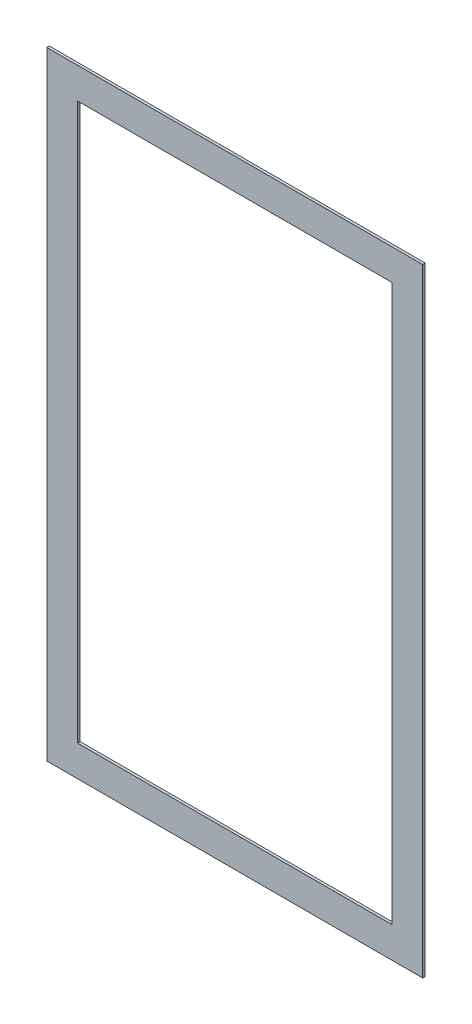
ISO-10303-21;
HEADER;
FILE_DESCRIPTION(('STEP AP214'),'2;1');
FILE_NAME('part.step','',(''),(''),'','','');
FILE_SCHEMA(('AUTOMOTIVE_DESIGN { 1 0 10303 214 1 1 1 1 }'));
ENDSEC;
DATA;
#1=APPLICATION_CONTEXT('core data for automotive mechanical design processes');
#2=APPLICATION_PROTOCOL_DEFINITION('international standard','automotive_design',2000,#1);
#3=PRODUCT_CONTEXT('',#1,'mechanical');
#4=PRODUCT('Part','Part','',(#3));
#5=PRODUCT_RELATED_PRODUCT_CATEGORY('part','',(#4));
#6=PRODUCT_DEFINITION_FORMATION('','',#4);
#7=PRODUCT_DEFINITION_CONTEXT('part definition',#1,'design');
#8=PRODUCT_DEFINITION('design','',#6,#7);
#9=PRODUCT_DEFINITION_SHAPE('','',#8);
#10=(LENGTH_UNIT() NAMED_UNIT(*) SI_UNIT(.MILLI.,.METRE.));
#11=(NAMED_UNIT(*) PLANE_ANGLE_UNIT() SI_UNIT($,.RADIAN.));
#12=(NAMED_UNIT(*) SI_UNIT($,.STERADIAN.) SOLID_ANGLE_UNIT());
#13=UNCERTAINTY_MEASURE_WITH_UNIT(LENGTH_MEASURE(1.E-05),#10,'distance_accuracy_value','');
#14=(GEOMETRIC_REPRESENTATION_CONTEXT(3) GLOBAL_UNCERTAINTY_ASSIGNED_CONTEXT((#13)) GLOBAL_UNIT_ASSIGNED_CONTEXT((#10,
#11,#12)) REPRESENTATION_CONTEXT('',''));
#15=CARTESIAN_POINT('',(0.,0.,0.));
#16=DIRECTION('',(0.,0.,1.));
#17=DIRECTION('',(1.,0.,0.));
#18=AXIS2_PLACEMENT_3D('',#15,#16,#17);
#19=CARTESIAN_POINT('',(0.,0.,6.35));
#20=DIRECTION('',(0.,0.,1.));
#21=DIRECTION('',(1.,0.,0.));
#22=AXIS2_PLACEMENT_3D('',#19,#20,#21);
#23=PLANE('',#22);
#24=DIRECTION('',(0.,-1.,0.));
#25=VECTOR('',#24,1.);
#26=CARTESIAN_POINT('',(-463.55,-762.,6.35));
#27=LINE('',#26,#25);
#28=CARTESIAN_POINT('',(-463.55,762.,6.35));
#29=VERTEX_POINT('',#28);
#30=CARTESIAN_POINT('',(-463.55,-762.,6.35));
#31=VERTEX_POINT('',#30);
#32=EDGE_CURVE('E159',#29,#31,#27,.T.);
#33=ORIENTED_EDGE('',*,*,#32,.T.);
#34=DIRECTION('',(1.,0.,0.));
#35=VECTOR('',#34,1.);
#36=CARTESIAN_POINT('',(463.55,-762.,6.35));
#37=LINE('',#36,#35);
#38=CARTESIAN_POINT('',(463.55,-762.,6.35));
#39=VERTEX_POINT('',#38);
#40=EDGE_CURVE('E163',#31,#39,#37,.T.);
#41=ORIENTED_EDGE('',*,*,#40,.T.);
#42=DIRECTION('',(0.,1.,0.));
#43=VECTOR('',#42,1.);
#44=CARTESIAN_POINT('',(463.55,-762.,6.35));
#45=LINE('',#44,#43);
#46=CARTESIAN_POINT('',(463.55,762.,6.35));
#47=VERTEX_POINT('',#46);
#48=EDGE_CURVE('E167',#39,#47,#45,.T.);
#49=ORIENTED_EDGE('',*,*,#48,.T.);
#50=DIRECTION('',(-1.,0.,0.));
#51=VECTOR('',#50,1.);
#52=CARTESIAN_POINT('',(463.55,762.,6.35));
#53=LINE('',#52,#51);
#54=EDGE_CURVE('E170',#47,#29,#53,.T.);
#55=ORIENTED_EDGE('',*,*,#54,.T.);
#56=EDGE_LOOP('',(#33,#41,#49,#55));
#57=FACE_BOUND('',#56,.T.);
#58=DIRECTION('',(1.,0.,0.));
#59=VECTOR('',#58,1.);
#60=CARTESIAN_POINT('',(387.35,-685.8,6.35));
#61=LINE('',#60,#59);
#62=CARTESIAN_POINT('',(-387.35,-685.8,6.35));
#63=VERTEX_POINT('',#62);
#64=CARTESIAN_POINT('',(387.35,-685.8,6.35));
#65=VERTEX_POINT('',#64);
#66=EDGE_CURVE('E120',#63,#65,#61,.T.);
#67=ORIENTED_EDGE('',*,*,#66,.F.);
#68=DIRECTION('',(0.,-1.,0.));
#69=VECTOR('',#68,1.);
#70=CARTESIAN_POINT('',(-387.35,-685.8,6.35));
#71=LINE('',#70,#69);
#72=CARTESIAN_POINT('',(-387.35,685.8,6.35));
#73=VERTEX_POINT('',#72);
#74=EDGE_CURVE('E111',#73,#63,#71,.T.);
#75=ORIENTED_EDGE('',*,*,#74,.F.);
#76=DIRECTION('',(-1.,0.,0.));
#77=VECTOR('',#76,1.);
#78=CARTESIAN_POINT('',(387.35,685.8,6.35));
#79=LINE('',#78,#77);
#80=CARTESIAN_POINT('',(387.35,685.8,6.35));
#81=VERTEX_POINT('',#80);
#82=EDGE_CURVE('E137',#81,#73,#79,.T.);
#83=ORIENTED_EDGE('',*,*,#82,.F.);
#84=DIRECTION('',(0.,1.,0.));
#85=VECTOR('',#84,1.);
#86=CARTESIAN_POINT('',(387.35,-685.8,6.35));
#87=LINE('',#86,#85);
#88=EDGE_CURVE('E133',#65,#81,#87,.T.);
#89=ORIENTED_EDGE('',*,*,#88,.F.);
#90=EDGE_LOOP('',(#67,#75,#83,#89));
#91=FACE_BOUND('',#90,.T.);
#92=ADVANCED_FACE('F45',(#57,#91),#23,.T.);
#93=CARTESIAN_POINT('',(0.,0.,0.));
#94=DIRECTION('',(0.,0.,1.));
#95=DIRECTION('',(1.,0.,0.));
#96=AXIS2_PLACEMENT_3D('',#93,#94,#95);
#97=PLANE('',#96);
#98=DIRECTION('',(0.,-1.,0.));
#99=VECTOR('',#98,1.);
#100=CARTESIAN_POINT('',(-463.55,-762.,0.));
#101=LINE('',#100,#99);
#102=CARTESIAN_POINT('',(-463.55,762.,0.));
#103=VERTEX_POINT('',#102);
#104=CARTESIAN_POINT('',(-463.55,-762.,0.));
#105=VERTEX_POINT('',#104);
#106=EDGE_CURVE('E129',#103,#105,#101,.T.);
#107=ORIENTED_EDGE('',*,*,#106,.F.);
#108=DIRECTION('',(-1.,0.,0.));
#109=VECTOR('',#108,1.);
#110=CARTESIAN_POINT('',(463.55,762.,0.));
#111=LINE('',#110,#109);
#112=CARTESIAN_POINT('',(463.55,762.,0.));
#113=VERTEX_POINT('',#112);
#114=EDGE_CURVE('E164',#113,#103,#111,.T.);
#115=ORIENTED_EDGE('',*,*,#114,.F.);
#116=DIRECTION('',(0.,1.,0.));
#117=VECTOR('',#116,1.);
#118=CARTESIAN_POINT('',(463.55,-762.,0.));
#119=LINE('',#118,#117);
#120=CARTESIAN_POINT('',(463.55,-762.,0.));
#121=VERTEX_POINT('',#120);
#122=EDGE_CURVE('E180',#121,#113,#119,.T.);
#123=ORIENTED_EDGE('',*,*,#122,.F.);
#124=DIRECTION('',(1.,0.,0.));
#125=VECTOR('',#124,1.);
#126=CARTESIAN_POINT('',(463.55,-762.,0.));
#127=LINE('',#126,#125);
#128=EDGE_CURVE('E177',#105,#121,#127,.T.);
#129=ORIENTED_EDGE('',*,*,#128,.F.);
#130=EDGE_LOOP('',(#107,#115,#123,#129));
#131=FACE_BOUND('',#130,.T.);
#132=DIRECTION('',(0.,-1.,0.));
#133=VECTOR('',#132,1.);
#134=CARTESIAN_POINT('',(-387.35,-685.8,0.));
#135=LINE('',#134,#133);
#136=CARTESIAN_POINT('',(-387.35,685.8,0.));
#137=VERTEX_POINT('',#136);
#138=CARTESIAN_POINT('',(-387.35,-685.8,0.));
#139=VERTEX_POINT('',#138);
#140=EDGE_CURVE('E69',#137,#139,#135,.T.);
#141=ORIENTED_EDGE('',*,*,#140,.T.);
#142=DIRECTION('',(1.,0.,0.));
#143=VECTOR('',#142,1.);
#144=CARTESIAN_POINT('',(387.35,-685.8,0.));
#145=LINE('',#144,#143);
#146=CARTESIAN_POINT('',(387.35,-685.8,0.));
#147=VERTEX_POINT('',#146);
#148=EDGE_CURVE('E127',#139,#147,#145,.T.);
#149=ORIENTED_EDGE('',*,*,#148,.T.);
#150=DIRECTION('',(0.,1.,0.));
#151=VECTOR('',#150,1.);
#152=CARTESIAN_POINT('',(387.35,-685.8,0.));
#153=LINE('',#152,#151);
#154=CARTESIAN_POINT('',(387.35,685.8,0.));
#155=VERTEX_POINT('',#154);
#156=EDGE_CURVE('E146',#147,#155,#153,.T.);
#157=ORIENTED_EDGE('',*,*,#156,.T.);
#158=DIRECTION('',(-1.,0.,0.));
#159=VECTOR('',#158,1.);
#160=CARTESIAN_POINT('',(387.35,685.8,0.));
#161=LINE('',#160,#159);
#162=EDGE_CURVE('E121',#155,#137,#161,.T.);
#163=ORIENTED_EDGE('',*,*,#162,.T.);
#164=EDGE_LOOP('',(#141,#149,#157,#163));
#165=FACE_BOUND('',#164,.T.);
#166=ADVANCED_FACE('F203',(#131,#165),#97,.F.);
#167=CARTESIAN_POINT('',(-463.55,-762.,6.35));
#168=DIRECTION('',(1.,0.,0.));
#169=DIRECTION('',(0.,0.,-1.));
#170=AXIS2_PLACEMENT_3D('',#167,#168,#169);
#171=PLANE('',#170);
#172=ORIENTED_EDGE('',*,*,#106,.T.);
#173=DIRECTION('',(0.,0.,-1.));
#174=VECTOR('',#173,1.);
#175=CARTESIAN_POINT('',(-463.55,-762.,6.35));
#176=LINE('',#175,#174);
#177=EDGE_CURVE('E11',#31,#105,#176,.T.);
#178=ORIENTED_EDGE('',*,*,#177,.F.);
#179=ORIENTED_EDGE('',*,*,#32,.F.);
#180=DIRECTION('',(0.,0.,-1.));
#181=VECTOR('',#180,1.);
#182=CARTESIAN_POINT('',(-463.55,762.,6.35));
#183=LINE('',#182,#181);
#184=EDGE_CURVE('E173',#29,#103,#183,.T.);
#185=ORIENTED_EDGE('',*,*,#184,.T.);
#186=EDGE_LOOP('',(#172,#178,#179,#185));
#187=FACE_BOUND('',#186,.T.);
#188=ADVANCED_FACE('F47',(#187),#171,.F.);
#189=CARTESIAN_POINT('',(463.55,-762.,6.35));
#190=DIRECTION('',(0.,1.,0.));
#191=DIRECTION('',(-1.,0.,0.));
#192=AXIS2_PLACEMENT_3D('',#189,#190,#191);
#193=PLANE('',#192);
#194=ORIENTED_EDGE('',*,*,#128,.T.);
#195=DIRECTION('',(0.,0.,-1.));
#196=VECTOR('',#195,1.);
#197=CARTESIAN_POINT('',(463.55,-762.,6.35));
#198=LINE('',#197,#196);
#199=EDGE_CURVE('E54',#39,#121,#198,.T.);
#200=ORIENTED_EDGE('',*,*,#199,.F.);
#201=ORIENTED_EDGE('',*,*,#40,.F.);
#202=ORIENTED_EDGE('',*,*,#177,.T.);
#203=EDGE_LOOP('',(#194,#200,#201,#202));
#204=FACE_BOUND('',#203,.T.);
#205=ADVANCED_FACE('F213',(#204),#193,.F.);
#206=CARTESIAN_POINT('',(463.55,-762.,6.35));
#207=DIRECTION('',(-1.,0.,0.));
#208=DIRECTION('',(0.,-1.,0.));
#209=AXIS2_PLACEMENT_3D('',#206,#207,#208);
#210=PLANE('',#209);
#211=ORIENTED_EDGE('',*,*,#122,.T.);
#212=DIRECTION('',(0.,0.,-1.));
#213=VECTOR('',#212,1.);
#214=CARTESIAN_POINT('',(463.55,762.,6.35));
#215=LINE('',#214,#213);
#216=EDGE_CURVE('E188',#47,#113,#215,.T.);
#217=ORIENTED_EDGE('',*,*,#216,.F.);
#218=ORIENTED_EDGE('',*,*,#48,.F.);
#219=ORIENTED_EDGE('',*,*,#199,.T.);
#220=EDGE_LOOP('',(#211,#217,#218,#219));
#221=FACE_BOUND('',#220,.T.);
#222=ADVANCED_FACE('F197',(#221),#210,.F.);
#223=CARTESIAN_POINT('',(463.55,762.,6.35));
#224=DIRECTION('',(0.,-1.,0.));
#225=DIRECTION('',(1.,0.,0.));
#226=AXIS2_PLACEMENT_3D('',#223,#224,#225);
#227=PLANE('',#226);
#228=ORIENTED_EDGE('',*,*,#114,.T.);
#229=ORIENTED_EDGE('',*,*,#184,.F.);
#230=ORIENTED_EDGE('',*,*,#54,.F.);
#231=ORIENTED_EDGE('',*,*,#216,.T.);
#232=EDGE_LOOP('',(#228,#229,#230,#231));
#233=FACE_BOUND('',#232,.T.);
#234=ADVANCED_FACE('F207',(#233),#227,.F.);
#235=CARTESIAN_POINT('',(-387.35,-685.8,6.35));
#236=DIRECTION('',(1.,0.,0.));
#237=DIRECTION('',(0.,0.,-1.));
#238=AXIS2_PLACEMENT_3D('',#235,#236,#237);
#239=PLANE('',#238);
#240=ORIENTED_EDGE('',*,*,#140,.F.);
#241=DIRECTION('',(0.,0.,-1.));
#242=VECTOR('',#241,1.);
#243=CARTESIAN_POINT('',(-387.35,685.8,6.35));
#244=LINE('',#243,#242);
#245=EDGE_CURVE('E115',#73,#137,#244,.T.);
#246=ORIENTED_EDGE('',*,*,#245,.F.);
#247=ORIENTED_EDGE('',*,*,#74,.T.);
#248=DIRECTION('',(0.,0.,-1.));
#249=VECTOR('',#248,1.);
#250=CARTESIAN_POINT('',(-387.35,-685.8,6.35));
#251=LINE('',#250,#249);
#252=EDGE_CURVE('E114',#63,#139,#251,.T.);
#253=ORIENTED_EDGE('',*,*,#252,.T.);
#254=EDGE_LOOP('',(#240,#246,#247,#253));
#255=FACE_BOUND('',#254,.T.);
#256=ADVANCED_FACE('F113',(#255),#239,.T.);
#257=CARTESIAN_POINT('',(387.35,-685.8,6.35));
#258=DIRECTION('',(0.,1.,0.));
#259=DIRECTION('',(0.,0.,1.));
#260=AXIS2_PLACEMENT_3D('',#257,#258,#259);
#261=PLANE('',#260);
#262=ORIENTED_EDGE('',*,*,#148,.F.);
#263=ORIENTED_EDGE('',*,*,#252,.F.);
#264=ORIENTED_EDGE('',*,*,#66,.T.);
#265=DIRECTION('',(0.,0.,-1.));
#266=VECTOR('',#265,1.);
#267=CARTESIAN_POINT('',(387.35,-685.8,6.35));
#268=LINE('',#267,#266);
#269=EDGE_CURVE('E130',#65,#147,#268,.T.);
#270=ORIENTED_EDGE('',*,*,#269,.T.);
#271=EDGE_LOOP('',(#262,#263,#264,#270));
#272=FACE_BOUND('',#271,.T.);
#273=ADVANCED_FACE('F124',(#272),#261,.T.);
#274=CARTESIAN_POINT('',(387.35,-685.8,6.35));
#275=DIRECTION('',(-1.,0.,0.));
#276=DIRECTION('',(0.,0.,1.));
#277=AXIS2_PLACEMENT_3D('',#274,#275,#276);
#278=PLANE('',#277);
#279=ORIENTED_EDGE('',*,*,#156,.F.);
#280=ORIENTED_EDGE('',*,*,#269,.F.);
#281=ORIENTED_EDGE('',*,*,#88,.T.);
#282=DIRECTION('',(0.,0.,-1.));
#283=VECTOR('',#282,1.);
#284=CARTESIAN_POINT('',(387.35,685.8,6.35));
#285=LINE('',#284,#283);
#286=EDGE_CURVE('E61',#81,#155,#285,.T.);
#287=ORIENTED_EDGE('',*,*,#286,.T.);
#288=EDGE_LOOP('',(#279,#280,#281,#287));
#289=FACE_BOUND('',#288,.T.);
#290=ADVANCED_FACE('F236',(#289),#278,.T.);
#291=CARTESIAN_POINT('',(387.35,685.8,6.35));
#292=DIRECTION('',(0.,-1.,0.));
#293=DIRECTION('',(0.,0.,-1.));
#294=AXIS2_PLACEMENT_3D('',#291,#292,#293);
#295=PLANE('',#294);
#296=ORIENTED_EDGE('',*,*,#162,.F.);
#297=ORIENTED_EDGE('',*,*,#286,.F.);
#298=ORIENTED_EDGE('',*,*,#82,.T.);
#299=ORIENTED_EDGE('',*,*,#245,.T.);
#300=EDGE_LOOP('',(#296,#297,#298,#299));
#301=FACE_BOUND('',#300,.T.);
#302=ADVANCED_FACE('F240',(#301),#295,.T.);
#303=CLOSED_SHELL('',(#92,#166,#188,#205,#222,#234,#256,#273,#290,#302));
#304=MANIFOLD_SOLID_BREP('B2',#303);
#305=ADVANCED_BREP_SHAPE_REPRESENTATION('',(#18,#304),#14);
#306=SHAPE_DEFINITION_REPRESENTATION(#9,#305);
ENDSEC;
END-ISO-10303-21;
